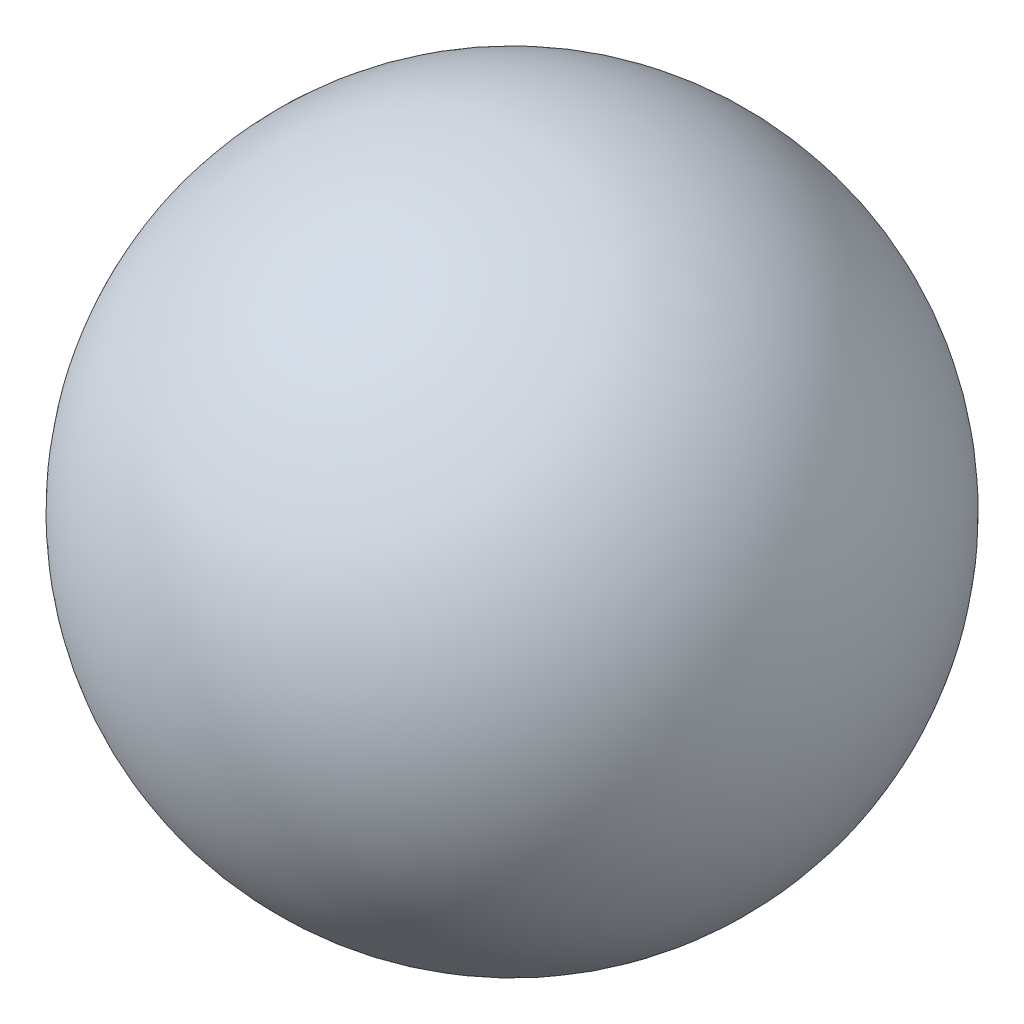
ISO-10303-21;
HEADER;
FILE_DESCRIPTION(('STEP AP214'),'2;1');
FILE_NAME('part.step','',(''),(''),'','','');
FILE_SCHEMA(('AUTOMOTIVE_DESIGN { 1 0 10303 214 1 1 1 1 }'));
ENDSEC;
DATA;
#1=APPLICATION_CONTEXT('core data for automotive mechanical design processes');
#2=APPLICATION_PROTOCOL_DEFINITION('international standard','automotive_design',2000,#1);
#3=PRODUCT_CONTEXT('',#1,'mechanical');
#4=PRODUCT('Part','Part','',(#3));
#5=PRODUCT_RELATED_PRODUCT_CATEGORY('part','',(#4));
#6=PRODUCT_DEFINITION_FORMATION('','',#4);
#7=PRODUCT_DEFINITION_CONTEXT('part definition',#1,'design');
#8=PRODUCT_DEFINITION('design','',#6,#7);
#9=PRODUCT_DEFINITION_SHAPE('','',#8);
#10=(LENGTH_UNIT() NAMED_UNIT(*) SI_UNIT(.MILLI.,.METRE.));
#11=(NAMED_UNIT(*) PLANE_ANGLE_UNIT() SI_UNIT($,.RADIAN.));
#12=(NAMED_UNIT(*) SI_UNIT($,.STERADIAN.) SOLID_ANGLE_UNIT());
#13=UNCERTAINTY_MEASURE_WITH_UNIT(LENGTH_MEASURE(1.E-05),#10,'distance_accuracy_value','');
#14=(GEOMETRIC_REPRESENTATION_CONTEXT(3) GLOBAL_UNCERTAINTY_ASSIGNED_CONTEXT((#13)) GLOBAL_UNIT_ASSIGNED_CONTEXT((#10,
#11,#12)) REPRESENTATION_CONTEXT('',''));
#15=CARTESIAN_POINT('',(0.,0.,0.));
#16=DIRECTION('',(0.,0.,1.));
#17=DIRECTION('',(1.,0.,0.));
#18=AXIS2_PLACEMENT_3D('',#15,#16,#17);
#19=CARTESIAN_POINT('',(0.,10.31875,0.));
#20=DIRECTION('',(1.,0.,0.));
#21=DIRECTION('',(0.,1.,0.));
#22=AXIS2_PLACEMENT_3D('',#19,#20,#21);
#23=SPHERICAL_SURFACE('',#22,1.71627890103155);
#24=CARTESIAN_POINT('',(1.71627890103155,10.31875,0.));
#25=VERTEX_POINT('',#24);
#26=VERTEX_LOOP('',#25);
#27=FACE_BOUND('',#26,.T.);
#28=CARTESIAN_POINT('',(-1.71627890103155,10.31875,0.));
#29=VERTEX_POINT('',#28);
#30=VERTEX_LOOP('',#29);
#31=FACE_BOUND('',#30,.T.);
#32=ADVANCED_FACE('F16',(#27,#31),#23,.T.);
#33=CLOSED_SHELL('',(#32));
#34=MANIFOLD_SOLID_BREP('B1',#33);
#35=ADVANCED_BREP_SHAPE_REPRESENTATION('',(#18,#34),#14);
#36=SHAPE_DEFINITION_REPRESENTATION(#9,#35);
ENDSEC;
END-ISO-10303-21;
